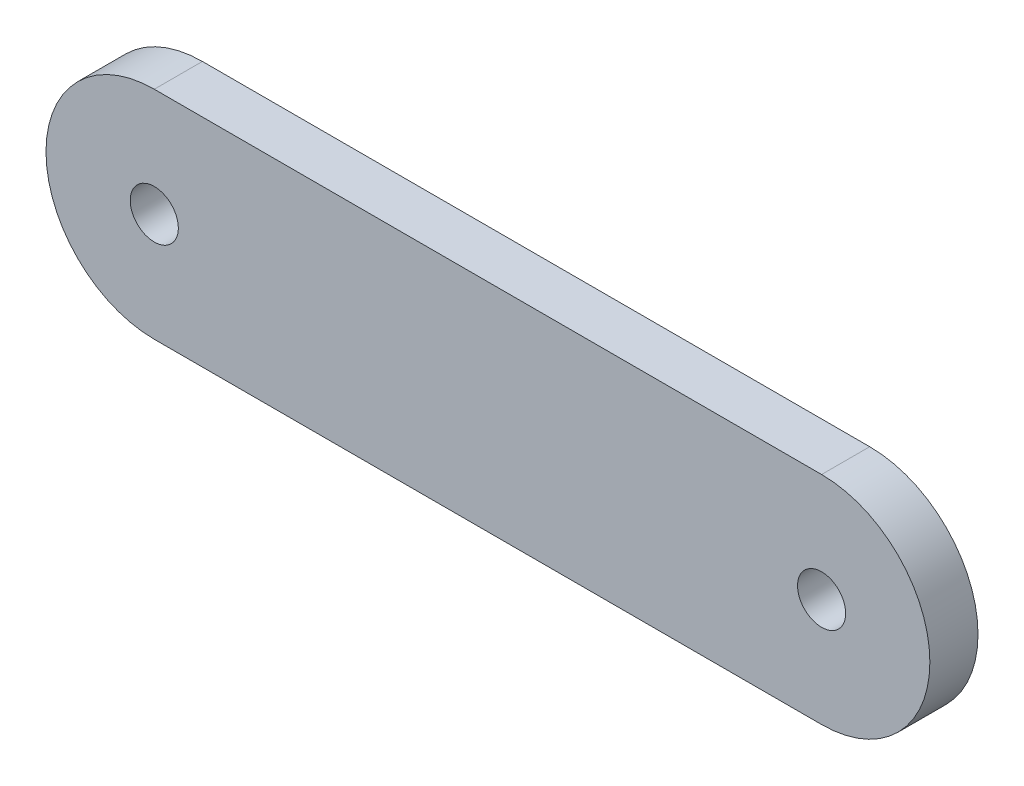
ISO-10303-21;
HEADER;
FILE_DESCRIPTION(('STEP AP214'),'2;1');
FILE_NAME('part.step','',(''),(''),'','','');
FILE_SCHEMA(('AUTOMOTIVE_DESIGN { 1 0 10303 214 1 1 1 1 }'));
ENDSEC;
DATA;
#1=APPLICATION_CONTEXT('core data for automotive mechanical design processes');
#2=APPLICATION_PROTOCOL_DEFINITION('international standard','automotive_design',2000,#1);
#3=PRODUCT_CONTEXT('',#1,'mechanical');
#4=PRODUCT('Part','Part','',(#3));
#5=PRODUCT_RELATED_PRODUCT_CATEGORY('part','',(#4));
#6=PRODUCT_DEFINITION_FORMATION('','',#4);
#7=PRODUCT_DEFINITION_CONTEXT('part definition',#1,'design');
#8=PRODUCT_DEFINITION('design','',#6,#7);
#9=PRODUCT_DEFINITION_SHAPE('','',#8);
#10=(LENGTH_UNIT() NAMED_UNIT(*) SI_UNIT(.MILLI.,.METRE.));
#11=(NAMED_UNIT(*) PLANE_ANGLE_UNIT() SI_UNIT($,.RADIAN.));
#12=(NAMED_UNIT(*) SI_UNIT($,.STERADIAN.) SOLID_ANGLE_UNIT());
#13=UNCERTAINTY_MEASURE_WITH_UNIT(LENGTH_MEASURE(1.E-05),#10,'distance_accuracy_value','');
#14=(GEOMETRIC_REPRESENTATION_CONTEXT(3) GLOBAL_UNCERTAINTY_ASSIGNED_CONTEXT((#13)) GLOBAL_UNIT_ASSIGNED_CONTEXT((#10,
#11,#12)) REPRESENTATION_CONTEXT('',''));
#15=CARTESIAN_POINT('',(0.,0.,0.));
#16=DIRECTION('',(0.,0.,1.));
#17=DIRECTION('',(1.,0.,0.));
#18=AXIS2_PLACEMENT_3D('',#15,#16,#17);
#19=CARTESIAN_POINT('',(2.24949503369489,0.,1.));
#20=DIRECTION('',(0.,0.,1.));
#21=DIRECTION('',(1.,0.,0.));
#22=AXIS2_PLACEMENT_3D('',#19,#20,#21);
#23=PLANE('',#22);
#24=CARTESIAN_POINT('',(2.24949503369489,0.,1.));
#25=DIRECTION('',(0.,0.,1.));
#26=DIRECTION('',(1.,0.,0.));
#27=AXIS2_PLACEMENT_3D('',#24,#25,#26);
#28=CIRCLE('',#27,0.5);
#29=CARTESIAN_POINT('',(2.74949503369489,0.,1.));
#30=VERTEX_POINT('',#29);
#31=EDGE_CURVE('E100',#30,#30,#28,.T.);
#32=ORIENTED_EDGE('',*,*,#31,.F.);
#33=EDGE_LOOP('',(#32));
#34=FACE_BOUND('',#33,.T.);
#35=CARTESIAN_POINT('',(2.24949503369489,0.,1.));
#36=DIRECTION('',(0.,0.,1.));
#37=DIRECTION('',(1.,0.,0.));
#38=AXIS2_PLACEMENT_3D('',#35,#36,#37);
#39=CIRCLE('',#38,2.25);
#40=CARTESIAN_POINT('',(2.24949503369489,2.25,1.));
#41=VERTEX_POINT('',#40);
#42=CARTESIAN_POINT('',(2.24949503369489,-2.25,1.));
#43=VERTEX_POINT('',#42);
#44=EDGE_CURVE('E85',#41,#43,#39,.T.);
#45=ORIENTED_EDGE('',*,*,#44,.T.);
#46=DIRECTION('',(1.,0.,0.));
#47=VECTOR('',#46,1.);
#48=CARTESIAN_POINT('',(2.24949503369489,-2.25,1.));
#49=LINE('',#48,#47);
#50=CARTESIAN_POINT('',(16.1156270069799,-2.25,1.));
#51=VERTEX_POINT('',#50);
#52=EDGE_CURVE('E80',#43,#51,#49,.T.);
#53=ORIENTED_EDGE('',*,*,#52,.T.);
#54=CARTESIAN_POINT('',(16.1156270069799,0.,1.));
#55=DIRECTION('',(0.,0.,1.));
#56=DIRECTION('',(1.,0.,0.));
#57=AXIS2_PLACEMENT_3D('',#54,#55,#56);
#58=CIRCLE('',#57,2.25);
#59=CARTESIAN_POINT('',(16.1156270069799,2.25,1.));
#60=VERTEX_POINT('',#59);
#61=EDGE_CURVE('E83',#51,#60,#58,.T.);
#62=ORIENTED_EDGE('',*,*,#61,.T.);
#63=DIRECTION('',(-1.,0.,0.));
#64=VECTOR('',#63,1.);
#65=CARTESIAN_POINT('',(2.24949503369489,2.25,1.));
#66=LINE('',#65,#64);
#67=EDGE_CURVE('E50',#60,#41,#66,.T.);
#68=ORIENTED_EDGE('',*,*,#67,.T.);
#69=EDGE_LOOP('',(#45,#53,#62,#68));
#70=FACE_BOUND('',#69,.T.);
#71=CARTESIAN_POINT('',(16.1156270069799,0.,1.));
#72=DIRECTION('',(0.,0.,1.));
#73=DIRECTION('',(1.,0.,0.));
#74=AXIS2_PLACEMENT_3D('',#71,#72,#73);
#75=CIRCLE('',#74,0.499999999999999);
#76=CARTESIAN_POINT('',(16.6156270069799,0.,1.));
#77=VERTEX_POINT('',#76);
#78=EDGE_CURVE('E115',#77,#77,#75,.T.);
#79=ORIENTED_EDGE('',*,*,#78,.F.);
#80=EDGE_LOOP('',(#79));
#81=FACE_BOUND('',#80,.T.);
#82=ADVANCED_FACE('F33',(#34,#70,#81),#23,.T.);
#83=CARTESIAN_POINT('',(2.24949503369489,0.,0.));
#84=DIRECTION('',(0.,0.,1.));
#85=DIRECTION('',(1.,0.,0.));
#86=AXIS2_PLACEMENT_3D('',#83,#84,#85);
#87=PLANE('',#86);
#88=CARTESIAN_POINT('',(2.24949503369489,0.,0.));
#89=DIRECTION('',(0.,0.,1.));
#90=DIRECTION('',(1.,0.,0.));
#91=AXIS2_PLACEMENT_3D('',#88,#89,#90);
#92=CIRCLE('',#91,2.25);
#93=CARTESIAN_POINT('',(2.24949503369489,2.25,0.));
#94=VERTEX_POINT('',#93);
#95=CARTESIAN_POINT('',(2.24949503369489,-2.25,0.));
#96=VERTEX_POINT('',#95);
#97=EDGE_CURVE('E97',#94,#96,#92,.T.);
#98=ORIENTED_EDGE('',*,*,#97,.F.);
#99=DIRECTION('',(-1.,0.,0.));
#100=VECTOR('',#99,1.);
#101=CARTESIAN_POINT('',(2.24949503369489,2.25,0.));
#102=LINE('',#101,#100);
#103=CARTESIAN_POINT('',(16.1156270069799,2.25,0.));
#104=VERTEX_POINT('',#103);
#105=EDGE_CURVE('E73',#104,#94,#102,.T.);
#106=ORIENTED_EDGE('',*,*,#105,.F.);
#107=CARTESIAN_POINT('',(16.1156270069799,0.,0.));
#108=DIRECTION('',(0.,0.,1.));
#109=DIRECTION('',(1.,0.,0.));
#110=AXIS2_PLACEMENT_3D('',#107,#108,#109);
#111=CIRCLE('',#110,2.25);
#112=CARTESIAN_POINT('',(16.1156270069799,-2.25,0.));
#113=VERTEX_POINT('',#112);
#114=EDGE_CURVE('E67',#113,#104,#111,.T.);
#115=ORIENTED_EDGE('',*,*,#114,.F.);
#116=DIRECTION('',(1.,0.,0.));
#117=VECTOR('',#116,1.);
#118=CARTESIAN_POINT('',(2.24949503369489,-2.25,0.));
#119=LINE('',#118,#117);
#120=EDGE_CURVE('E89',#96,#113,#119,.T.);
#121=ORIENTED_EDGE('',*,*,#120,.F.);
#122=EDGE_LOOP('',(#98,#106,#115,#121));
#123=FACE_BOUND('',#122,.T.);
#124=CARTESIAN_POINT('',(2.24949503369489,0.,0.));
#125=DIRECTION('',(0.,0.,1.));
#126=DIRECTION('',(1.,0.,0.));
#127=AXIS2_PLACEMENT_3D('',#124,#125,#126);
#128=CIRCLE('',#127,0.5);
#129=CARTESIAN_POINT('',(2.74949503369489,0.,0.));
#130=VERTEX_POINT('',#129);
#131=EDGE_CURVE('E112',#130,#130,#128,.T.);
#132=ORIENTED_EDGE('',*,*,#131,.T.);
#133=EDGE_LOOP('',(#132));
#134=FACE_BOUND('',#133,.T.);
#135=CARTESIAN_POINT('',(16.1156270069799,0.,0.));
#136=DIRECTION('',(0.,0.,1.));
#137=DIRECTION('',(1.,0.,0.));
#138=AXIS2_PLACEMENT_3D('',#135,#136,#137);
#139=CIRCLE('',#138,0.499999999999999);
#140=CARTESIAN_POINT('',(16.6156270069799,0.,0.));
#141=VERTEX_POINT('',#140);
#142=EDGE_CURVE('E118',#141,#141,#139,.T.);
#143=ORIENTED_EDGE('',*,*,#142,.T.);
#144=EDGE_LOOP('',(#143));
#145=FACE_BOUND('',#144,.T.);
#146=ADVANCED_FACE('F108',(#123,#134,#145),#87,.F.);
#147=CARTESIAN_POINT('',(2.24949503369489,0.,1.));
#148=DIRECTION('',(0.,0.,-1.));
#149=DIRECTION('',(-1.,0.,0.));
#150=AXIS2_PLACEMENT_3D('',#147,#148,#149);
#151=CYLINDRICAL_SURFACE('',#150,2.25);
#152=ORIENTED_EDGE('',*,*,#97,.T.);
#153=DIRECTION('',(0.,0.,-1.));
#154=VECTOR('',#153,1.);
#155=CARTESIAN_POINT('',(2.24949503369489,-2.25,1.));
#156=LINE('',#155,#154);
#157=EDGE_CURVE('E11',#43,#96,#156,.T.);
#158=ORIENTED_EDGE('',*,*,#157,.F.);
#159=ORIENTED_EDGE('',*,*,#44,.F.);
#160=DIRECTION('',(0.,0.,-1.));
#161=VECTOR('',#160,1.);
#162=CARTESIAN_POINT('',(2.24949503369489,2.25,1.));
#163=LINE('',#162,#161);
#164=EDGE_CURVE('E93',#41,#94,#163,.T.);
#165=ORIENTED_EDGE('',*,*,#164,.T.);
#166=EDGE_LOOP('',(#152,#158,#159,#165));
#167=FACE_BOUND('',#166,.T.);
#168=ADVANCED_FACE('F35',(#167),#151,.T.);
#169=CARTESIAN_POINT('',(2.24949503369489,-2.25,1.));
#170=DIRECTION('',(0.,1.,0.));
#171=DIRECTION('',(-1.,0.,0.));
#172=AXIS2_PLACEMENT_3D('',#169,#170,#171);
#173=PLANE('',#172);
#174=ORIENTED_EDGE('',*,*,#120,.T.);
#175=DIRECTION('',(0.,0.,-1.));
#176=VECTOR('',#175,1.);
#177=CARTESIAN_POINT('',(16.1156270069799,-2.25,1.));
#178=LINE('',#177,#176);
#179=EDGE_CURVE('E42',#51,#113,#178,.T.);
#180=ORIENTED_EDGE('',*,*,#179,.F.);
#181=ORIENTED_EDGE('',*,*,#52,.F.);
#182=ORIENTED_EDGE('',*,*,#157,.T.);
#183=EDGE_LOOP('',(#174,#180,#181,#182));
#184=FACE_BOUND('',#183,.T.);
#185=ADVANCED_FACE('F88',(#184),#173,.F.);
#186=CARTESIAN_POINT('',(16.1156270069799,0.,1.));
#187=DIRECTION('',(0.,0.,-1.));
#188=DIRECTION('',(-1.,0.,0.));
#189=AXIS2_PLACEMENT_3D('',#186,#187,#188);
#190=CYLINDRICAL_SURFACE('',#189,2.25);
#191=ORIENTED_EDGE('',*,*,#114,.T.);
#192=DIRECTION('',(0.,0.,-1.));
#193=VECTOR('',#192,1.);
#194=CARTESIAN_POINT('',(16.1156270069799,2.25,1.));
#195=LINE('',#194,#193);
#196=EDGE_CURVE('E90',#60,#104,#195,.T.);
#197=ORIENTED_EDGE('',*,*,#196,.F.);
#198=ORIENTED_EDGE('',*,*,#61,.F.);
#199=ORIENTED_EDGE('',*,*,#179,.T.);
#200=EDGE_LOOP('',(#191,#197,#198,#199));
#201=FACE_BOUND('',#200,.T.);
#202=ADVANCED_FACE('F91',(#201),#190,.T.);
#203=CARTESIAN_POINT('',(2.24949503369489,2.25,1.));
#204=DIRECTION('',(0.,-1.,0.));
#205=DIRECTION('',(1.,0.,0.));
#206=AXIS2_PLACEMENT_3D('',#203,#204,#205);
#207=PLANE('',#206);
#208=ORIENTED_EDGE('',*,*,#105,.T.);
#209=ORIENTED_EDGE('',*,*,#164,.F.);
#210=ORIENTED_EDGE('',*,*,#67,.F.);
#211=ORIENTED_EDGE('',*,*,#196,.T.);
#212=EDGE_LOOP('',(#208,#209,#210,#211));
#213=FACE_BOUND('',#212,.T.);
#214=ADVANCED_FACE('F105',(#213),#207,.F.);
#215=CARTESIAN_POINT('',(2.24949503369489,0.,1.));
#216=DIRECTION('',(0.,0.,-1.));
#217=DIRECTION('',(-1.,0.,0.));
#218=AXIS2_PLACEMENT_3D('',#215,#216,#217);
#219=CYLINDRICAL_SURFACE('',#218,0.5);
#220=ORIENTED_EDGE('',*,*,#31,.T.);
#221=EDGE_LOOP('',(#220));
#222=FACE_BOUND('',#221,.T.);
#223=ORIENTED_EDGE('',*,*,#131,.F.);
#224=EDGE_LOOP('',(#223));
#225=FACE_BOUND('',#224,.T.);
#226=ADVANCED_FACE('F135',(#222,#225),#219,.F.);
#227=CARTESIAN_POINT('',(16.1156270069799,0.,1.));
#228=DIRECTION('',(0.,0.,-1.));
#229=DIRECTION('',(-1.,0.,0.));
#230=AXIS2_PLACEMENT_3D('',#227,#228,#229);
#231=CYLINDRICAL_SURFACE('',#230,0.499999999999999);
#232=ORIENTED_EDGE('',*,*,#78,.T.);
#233=EDGE_LOOP('',(#232));
#234=FACE_BOUND('',#233,.T.);
#235=ORIENTED_EDGE('',*,*,#142,.F.);
#236=EDGE_LOOP('',(#235));
#237=FACE_BOUND('',#236,.T.);
#238=ADVANCED_FACE('F124',(#234,#237),#231,.F.);
#239=CLOSED_SHELL('',(#82,#146,#168,#185,#202,#214,#226,#238));
#240=MANIFOLD_SOLID_BREP('B2',#239);
#241=ADVANCED_BREP_SHAPE_REPRESENTATION('',(#18,#240),#14);
#242=SHAPE_DEFINITION_REPRESENTATION(#9,#241);
ENDSEC;
END-ISO-10303-21;
